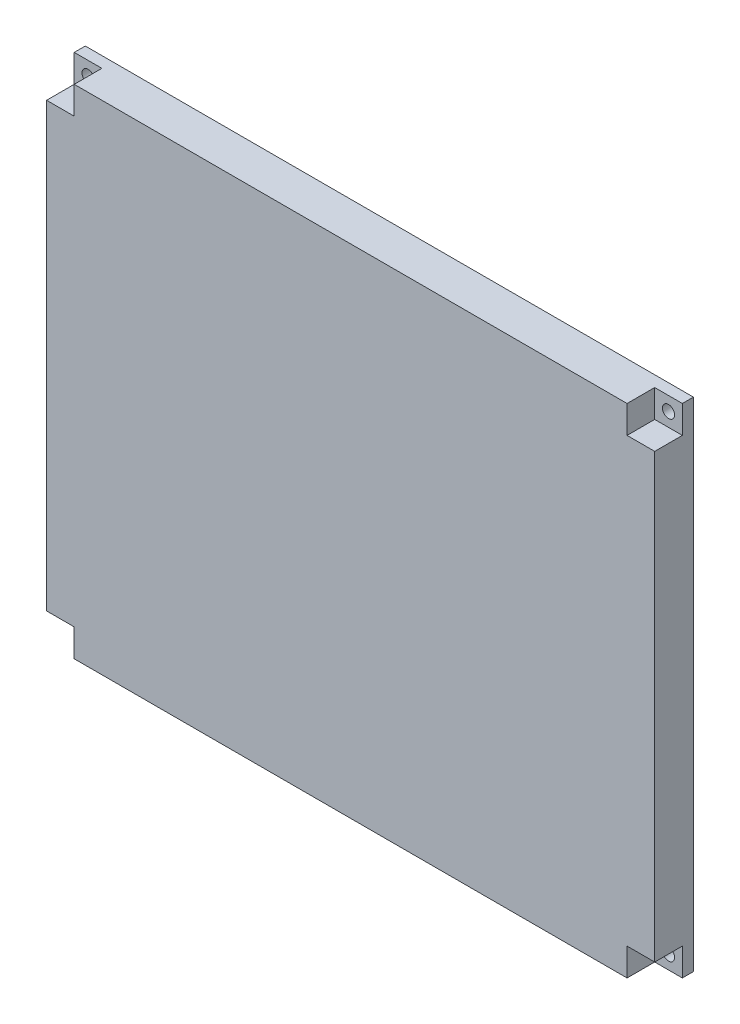
ISO-10303-21;
HEADER;
FILE_DESCRIPTION(('STEP AP214'),'2;1');
FILE_NAME('part.step','',(''),(''),'','','');
FILE_SCHEMA(('AUTOMOTIVE_DESIGN { 1 0 10303 214 1 1 1 1 }'));
ENDSEC;
DATA;
#1=APPLICATION_CONTEXT('core data for automotive mechanical design processes');
#2=APPLICATION_PROTOCOL_DEFINITION('international standard','automotive_design',2000,#1);
#3=PRODUCT_CONTEXT('',#1,'mechanical');
#4=PRODUCT('Part','Part','',(#3));
#5=PRODUCT_RELATED_PRODUCT_CATEGORY('part','',(#4));
#6=PRODUCT_DEFINITION_FORMATION('','',#4);
#7=PRODUCT_DEFINITION_CONTEXT('part definition',#1,'design');
#8=PRODUCT_DEFINITION('design','',#6,#7);
#9=PRODUCT_DEFINITION_SHAPE('','',#8);
#10=(LENGTH_UNIT() NAMED_UNIT(*) SI_UNIT(.MILLI.,.METRE.));
#11=(NAMED_UNIT(*) PLANE_ANGLE_UNIT() SI_UNIT($,.RADIAN.));
#12=(NAMED_UNIT(*) SI_UNIT($,.STERADIAN.) SOLID_ANGLE_UNIT());
#13=UNCERTAINTY_MEASURE_WITH_UNIT(LENGTH_MEASURE(1.E-05),#10,'distance_accuracy_value','');
#14=(GEOMETRIC_REPRESENTATION_CONTEXT(3) GLOBAL_UNCERTAINTY_ASSIGNED_CONTEXT((#13)) GLOBAL_UNIT_ASSIGNED_CONTEXT((#10,
#11,#12)) REPRESENTATION_CONTEXT('',''));
#15=CARTESIAN_POINT('',(0.,0.,0.));
#16=DIRECTION('',(0.,0.,1.));
#17=DIRECTION('',(1.,0.,0.));
#18=AXIS2_PLACEMENT_3D('',#15,#16,#17);
#19=CARTESIAN_POINT('',(-89.0867155495886,42.9813664596273,10.));
#20=DIRECTION('',(0.,1.,0.));
#21=DIRECTION('',(0.,0.,1.));
#22=AXIS2_PLACEMENT_3D('',#19,#20,#21);
#23=PLANE('',#22);
#24=DIRECTION('',(1.,0.,0.));
#25=VECTOR('',#24,1.);
#26=CARTESIAN_POINT('',(-84.0867155495887,42.9813664596273,3.));
#27=LINE('',#26,#25);
#28=CARTESIAN_POINT('',(-84.0867155495886,42.9813664596273,3.));
#29=VERTEX_POINT('',#28);
#30=CARTESIAN_POINT('',(25.9132844504113,42.9813664596273,3.));
#31=VERTEX_POINT('',#30);
#32=EDGE_CURVE('E177',#29,#31,#27,.T.);
#33=ORIENTED_EDGE('',*,*,#32,.F.);
#34=DIRECTION('',(0.,0.,-1.));
#35=VECTOR('',#34,1.);
#36=CARTESIAN_POINT('',(-84.0867155495886,42.9813664596273,3.));
#37=LINE('',#36,#35);
#38=CARTESIAN_POINT('',(-84.0867155495886,42.9813664596273,5.));
#39=VERTEX_POINT('',#38);
#40=EDGE_CURVE('E57',#39,#29,#37,.T.);
#41=ORIENTED_EDGE('',*,*,#40,.F.);
#42=DIRECTION('',(-1.,0.,0.));
#43=VECTOR('',#42,1.);
#44=CARTESIAN_POINT('',(-84.0867155495886,42.9813664596273,5.));
#45=LINE('',#44,#43);
#46=CARTESIAN_POINT('',(-79.0867155495886,42.9813664596273,5.));
#47=VERTEX_POINT('',#46);
#48=EDGE_CURVE('E297',#47,#39,#45,.T.);
#49=ORIENTED_EDGE('',*,*,#48,.F.);
#50=DIRECTION('',(0.,0.,1.));
#51=VECTOR('',#50,1.);
#52=CARTESIAN_POINT('',(-79.0867155495886,42.9813664596273,5.));
#53=LINE('',#52,#51);
#54=CARTESIAN_POINT('',(-79.0867155495886,42.9813664596273,10.));
#55=VERTEX_POINT('',#54);
#56=EDGE_CURVE('E307',#47,#55,#53,.T.);
#57=ORIENTED_EDGE('',*,*,#56,.T.);
#58=DIRECTION('',(1.,0.,0.));
#59=VECTOR('',#58,1.);
#60=CARTESIAN_POINT('',(-89.0867155495886,42.9813664596273,10.));
#61=LINE('',#60,#59);
#62=CARTESIAN_POINT('',(20.9132844504113,42.9813664596273,10.));
#63=VERTEX_POINT('',#62);
#64=EDGE_CURVE('E49',#55,#63,#61,.T.);
#65=ORIENTED_EDGE('',*,*,#64,.T.);
#66=DIRECTION('',(0.,0.,1.));
#67=VECTOR('',#66,1.);
#68=CARTESIAN_POINT('',(20.9132844504113,42.9813664596273,5.));
#69=LINE('',#68,#67);
#70=CARTESIAN_POINT('',(20.9132844504113,42.9813664596273,5.));
#71=VERTEX_POINT('',#70);
#72=EDGE_CURVE('E238',#71,#63,#69,.T.);
#73=ORIENTED_EDGE('',*,*,#72,.F.);
#74=DIRECTION('',(-1.,0.,0.));
#75=VECTOR('',#74,1.);
#76=CARTESIAN_POINT('',(25.9132844504113,42.9813664596273,5.));
#77=LINE('',#76,#75);
#78=CARTESIAN_POINT('',(25.9132844504113,42.9813664596273,5.));
#79=VERTEX_POINT('',#78);
#80=EDGE_CURVE('E225',#79,#71,#77,.T.);
#81=ORIENTED_EDGE('',*,*,#80,.F.);
#82=DIRECTION('',(0.,0.,1.));
#83=VECTOR('',#82,1.);
#84=CARTESIAN_POINT('',(25.9132844504113,42.9813664596273,3.));
#85=LINE('',#84,#83);
#86=EDGE_CURVE('E352',#31,#79,#85,.T.);
#87=ORIENTED_EDGE('',*,*,#86,.F.);
#88=EDGE_LOOP('',(#33,#41,#49,#57,#65,#73,#81,#87));
#89=FACE_BOUND('',#88,.T.);
#90=ADVANCED_FACE('F40',(#89),#23,.T.);
#91=CARTESIAN_POINT('',(-89.0867155495886,-47.0186335403727,10.));
#92=DIRECTION('',(0.,1.,0.));
#93=DIRECTION('',(0.,0.,1.));
#94=AXIS2_PLACEMENT_3D('',#91,#92,#93);
#95=PLANE('',#94);
#96=DIRECTION('',(0.,0.,1.));
#97=VECTOR('',#96,1.);
#98=CARTESIAN_POINT('',(-84.0867155495886,-47.0186335403727,3.));
#99=LINE('',#98,#97);
#100=CARTESIAN_POINT('',(-84.0867155495886,-47.0186335403727,3.));
#101=VERTEX_POINT('',#100);
#102=CARTESIAN_POINT('',(-84.0867155495886,-47.0186335403727,5.));
#103=VERTEX_POINT('',#102);
#104=EDGE_CURVE('E156',#101,#103,#99,.T.);
#105=ORIENTED_EDGE('',*,*,#104,.F.);
#106=DIRECTION('',(-1.,0.,0.));
#107=VECTOR('',#106,1.);
#108=CARTESIAN_POINT('',(25.9132844504114,-47.0186335403726,3.));
#109=LINE('',#108,#107);
#110=CARTESIAN_POINT('',(25.9132844504114,-47.0186335403726,3.));
#111=VERTEX_POINT('',#110);
#112=EDGE_CURVE('E167',#111,#101,#109,.T.);
#113=ORIENTED_EDGE('',*,*,#112,.F.);
#114=DIRECTION('',(0.,0.,-1.));
#115=VECTOR('',#114,1.);
#116=CARTESIAN_POINT('',(25.9132844504114,-47.0186335403727,3.));
#117=LINE('',#116,#115);
#118=CARTESIAN_POINT('',(25.9132844504114,-47.0186335403727,5.));
#119=VERTEX_POINT('',#118);
#120=EDGE_CURVE('E65',#119,#111,#117,.T.);
#121=ORIENTED_EDGE('',*,*,#120,.F.);
#122=DIRECTION('',(1.,0.,0.));
#123=VECTOR('',#122,1.);
#124=CARTESIAN_POINT('',(25.9132844504113,-47.0186335403727,5.));
#125=LINE('',#124,#123);
#126=CARTESIAN_POINT('',(20.9132844504113,-47.0186335403727,5.));
#127=VERTEX_POINT('',#126);
#128=EDGE_CURVE('E187',#127,#119,#125,.T.);
#129=ORIENTED_EDGE('',*,*,#128,.F.);
#130=DIRECTION('',(0.,0.,1.));
#131=VECTOR('',#130,1.);
#132=CARTESIAN_POINT('',(20.9132844504113,-47.0186335403727,5.));
#133=LINE('',#132,#131);
#134=CARTESIAN_POINT('',(20.9132844504113,-47.0186335403727,10.));
#135=VERTEX_POINT('',#134);
#136=EDGE_CURVE('E210',#127,#135,#133,.T.);
#137=ORIENTED_EDGE('',*,*,#136,.T.);
#138=DIRECTION('',(1.,0.,0.));
#139=VECTOR('',#138,1.);
#140=CARTESIAN_POINT('',(-89.0867155495886,-47.0186335403727,10.));
#141=LINE('',#140,#139);
#142=CARTESIAN_POINT('',(-79.0867155495886,-47.0186335403727,10.));
#143=VERTEX_POINT('',#142);
#144=EDGE_CURVE('E11',#143,#135,#141,.T.);
#145=ORIENTED_EDGE('',*,*,#144,.F.);
#146=DIRECTION('',(0.,0.,1.));
#147=VECTOR('',#146,1.);
#148=CARTESIAN_POINT('',(-79.0867155495886,-47.0186335403727,5.));
#149=LINE('',#148,#147);
#150=CARTESIAN_POINT('',(-79.0867155495886,-47.0186335403727,5.));
#151=VERTEX_POINT('',#150);
#152=EDGE_CURVE('E270',#151,#143,#149,.T.);
#153=ORIENTED_EDGE('',*,*,#152,.F.);
#154=DIRECTION('',(1.,0.,0.));
#155=VECTOR('',#154,1.);
#156=CARTESIAN_POINT('',(-84.0867155495886,-47.0186335403726,5.));
#157=LINE('',#156,#155);
#158=EDGE_CURVE('E170',#103,#151,#157,.T.);
#159=ORIENTED_EDGE('',*,*,#158,.F.);
#160=EDGE_LOOP('',(#105,#113,#121,#129,#137,#145,#153,#159));
#161=FACE_BOUND('',#160,.T.);
#162=ADVANCED_FACE('F166',(#161),#95,.F.);
#163=CARTESIAN_POINT('',(0.,0.,10.));
#164=DIRECTION('',(0.,0.,-1.));
#165=DIRECTION('',(-1.,0.,0.));
#166=AXIS2_PLACEMENT_3D('',#163,#164,#165);
#167=PLANE('',#166);
#168=DIRECTION('',(0.,1.,0.));
#169=VECTOR('',#168,1.);
#170=CARTESIAN_POINT('',(-84.0867155495886,42.9813664596273,10.));
#171=LINE('',#170,#169);
#172=CARTESIAN_POINT('',(-84.0867155495886,-42.0186335403727,10.));
#173=VERTEX_POINT('',#172);
#174=CARTESIAN_POINT('',(-84.0867155495886,37.9813664596273,10.));
#175=VERTEX_POINT('',#174);
#176=EDGE_CURVE('E172',#173,#175,#171,.T.);
#177=ORIENTED_EDGE('',*,*,#176,.F.);
#178=DIRECTION('',(-1.,0.,0.));
#179=VECTOR('',#178,1.);
#180=CARTESIAN_POINT('',(-84.0867155495886,-42.0186335403727,10.));
#181=LINE('',#180,#179);
#182=CARTESIAN_POINT('',(-79.0867155495886,-42.0186335403727,10.));
#183=VERTEX_POINT('',#182);
#184=EDGE_CURVE('E259',#183,#173,#181,.T.);
#185=ORIENTED_EDGE('',*,*,#184,.F.);
#186=DIRECTION('',(0.,1.,0.));
#187=VECTOR('',#186,1.);
#188=CARTESIAN_POINT('',(-79.0867155495886,-47.0186335403727,10.));
#189=LINE('',#188,#187);
#190=EDGE_CURVE('E214',#143,#183,#189,.T.);
#191=ORIENTED_EDGE('',*,*,#190,.F.);
#192=ORIENTED_EDGE('',*,*,#144,.T.);
#193=DIRECTION('',(0.,-1.,0.));
#194=VECTOR('',#193,1.);
#195=CARTESIAN_POINT('',(20.9132844504113,-47.0186335403727,10.));
#196=LINE('',#195,#194);
#197=CARTESIAN_POINT('',(20.9132844504113,-42.0186335403727,10.));
#198=VERTEX_POINT('',#197);
#199=EDGE_CURVE('E192',#198,#135,#196,.T.);
#200=ORIENTED_EDGE('',*,*,#199,.F.);
#201=DIRECTION('',(-1.,0.,0.));
#202=VECTOR('',#201,1.);
#203=CARTESIAN_POINT('',(25.9132844504113,-42.0186335403727,10.));
#204=LINE('',#203,#202);
#205=CARTESIAN_POINT('',(25.9132844504114,-42.0186335403727,10.));
#206=VERTEX_POINT('',#205);
#207=EDGE_CURVE('E182',#206,#198,#204,.T.);
#208=ORIENTED_EDGE('',*,*,#207,.F.);
#209=DIRECTION('',(0.,-1.,0.));
#210=VECTOR('',#209,1.);
#211=CARTESIAN_POINT('',(25.9132844504113,42.9813664596273,10.));
#212=LINE('',#211,#210);
#213=CARTESIAN_POINT('',(25.9132844504113,37.9813664596273,10.));
#214=VERTEX_POINT('',#213);
#215=EDGE_CURVE('E349',#214,#206,#212,.T.);
#216=ORIENTED_EDGE('',*,*,#215,.F.);
#217=DIRECTION('',(1.,0.,0.));
#218=VECTOR('',#217,1.);
#219=CARTESIAN_POINT('',(25.9132844504113,37.9813664596273,10.));
#220=LINE('',#219,#218);
#221=CARTESIAN_POINT('',(20.9132844504113,37.9813664596273,10.));
#222=VERTEX_POINT('',#221);
#223=EDGE_CURVE('E226',#222,#214,#220,.T.);
#224=ORIENTED_EDGE('',*,*,#223,.F.);
#225=DIRECTION('',(0.,-1.,0.));
#226=VECTOR('',#225,1.);
#227=CARTESIAN_POINT('',(20.9132844504113,42.9813664596273,10.));
#228=LINE('',#227,#226);
#229=EDGE_CURVE('E239',#63,#222,#228,.T.);
#230=ORIENTED_EDGE('',*,*,#229,.F.);
#231=ORIENTED_EDGE('',*,*,#64,.F.);
#232=DIRECTION('',(0.,1.,0.));
#233=VECTOR('',#232,1.);
#234=CARTESIAN_POINT('',(-79.0867155495886,42.9813664596273,10.));
#235=LINE('',#234,#233);
#236=CARTESIAN_POINT('',(-79.0867155495886,37.9813664596273,10.));
#237=VERTEX_POINT('',#236);
#238=EDGE_CURVE('E289',#237,#55,#235,.T.);
#239=ORIENTED_EDGE('',*,*,#238,.F.);
#240=DIRECTION('',(1.,0.,0.));
#241=VECTOR('',#240,1.);
#242=CARTESIAN_POINT('',(-84.0867155495886,37.9813664596273,10.));
#243=LINE('',#242,#241);
#244=EDGE_CURVE('E250',#175,#237,#243,.T.);
#245=ORIENTED_EDGE('',*,*,#244,.F.);
#246=EDGE_LOOP('',(#177,#185,#191,#192,#200,#208,#216,#224,#230,#231,#239,#245));
#247=FACE_BOUND('',#246,.T.);
#248=ADVANCED_FACE('F369',(#247),#167,.F.);
#249=CARTESIAN_POINT('',(0.,0.,3.));
#250=DIRECTION('',(0.,0.,1.));
#251=DIRECTION('',(1.,0.,0.));
#252=AXIS2_PLACEMENT_3D('',#249,#250,#251);
#253=PLANE('',#252);
#254=CARTESIAN_POINT('',(23.4132844504114,40.4813664596273,3.));
#255=DIRECTION('',(0.,0.,-1.));
#256=DIRECTION('',(-1.,0.,0.));
#257=AXIS2_PLACEMENT_3D('',#254,#255,#256);
#258=CIRCLE('',#257,1.1);
#259=CARTESIAN_POINT('',(22.3132844504114,40.4813664596273,3.));
#260=VERTEX_POINT('',#259);
#261=EDGE_CURVE('E43',#260,#260,#258,.T.);
#262=ORIENTED_EDGE('',*,*,#261,.F.);
#263=EDGE_LOOP('',(#262));
#264=FACE_BOUND('',#263,.T.);
#265=CARTESIAN_POINT('',(-81.5867155495887,40.4813664596273,3.));
#266=DIRECTION('',(0.,0.,1.));
#267=DIRECTION('',(1.,0.,0.));
#268=AXIS2_PLACEMENT_3D('',#265,#266,#267);
#269=CIRCLE('',#268,1.1);
#270=CARTESIAN_POINT('',(-80.4867155495887,40.4813664596273,3.));
#271=VERTEX_POINT('',#270);
#272=EDGE_CURVE('E329',#271,#271,#269,.T.);
#273=ORIENTED_EDGE('',*,*,#272,.T.);
#274=EDGE_LOOP('',(#273));
#275=FACE_BOUND('',#274,.T.);
#276=CARTESIAN_POINT('',(-81.5867155495887,-44.5186335403726,3.));
#277=DIRECTION('',(0.,0.,1.));
#278=DIRECTION('',(1.,0.,0.));
#279=AXIS2_PLACEMENT_3D('',#276,#277,#278);
#280=CIRCLE('',#279,1.1);
#281=CARTESIAN_POINT('',(-80.4867155495887,-44.5186335403726,3.));
#282=VERTEX_POINT('',#281);
#283=EDGE_CURVE('E325',#282,#282,#280,.T.);
#284=ORIENTED_EDGE('',*,*,#283,.T.);
#285=EDGE_LOOP('',(#284));
#286=FACE_BOUND('',#285,.T.);
#287=CARTESIAN_POINT('',(23.4132844504114,-44.5186335403726,3.));
#288=DIRECTION('',(0.,0.,1.));
#289=DIRECTION('',(1.,0.,0.));
#290=AXIS2_PLACEMENT_3D('',#287,#288,#289);
#291=CIRCLE('',#290,1.1);
#292=CARTESIAN_POINT('',(24.5132844504114,-44.5186335403726,3.));
#293=VERTEX_POINT('',#292);
#294=EDGE_CURVE('E320',#293,#293,#291,.T.);
#295=ORIENTED_EDGE('',*,*,#294,.T.);
#296=EDGE_LOOP('',(#295));
#297=FACE_BOUND('',#296,.T.);
#298=DIRECTION('',(0.,-1.,0.));
#299=VECTOR('',#298,1.);
#300=CARTESIAN_POINT('',(-84.0867155495886,42.9813664596273,3.));
#301=LINE('',#300,#299);
#302=EDGE_CURVE('E153',#29,#101,#301,.T.);
#303=ORIENTED_EDGE('',*,*,#302,.F.);
#304=ORIENTED_EDGE('',*,*,#32,.T.);
#305=DIRECTION('',(0.,1.,0.));
#306=VECTOR('',#305,1.);
#307=CARTESIAN_POINT('',(25.9132844504113,42.9813664596273,3.));
#308=LINE('',#307,#306);
#309=EDGE_CURVE('E175',#111,#31,#308,.T.);
#310=ORIENTED_EDGE('',*,*,#309,.F.);
#311=ORIENTED_EDGE('',*,*,#112,.T.);
#312=EDGE_LOOP('',(#303,#304,#310,#311));
#313=FACE_BOUND('',#312,.T.);
#314=ADVANCED_FACE('F174',(#264,#275,#286,#297,#313),#253,.F.);
#315=CARTESIAN_POINT('',(-79.0867155495886,42.9813664596273,5.));
#316=DIRECTION('',(1.,0.,0.));
#317=DIRECTION('',(0.,0.,-1.));
#318=AXIS2_PLACEMENT_3D('',#315,#316,#317);
#319=PLANE('',#318);
#320=ORIENTED_EDGE('',*,*,#238,.T.);
#321=ORIENTED_EDGE('',*,*,#56,.F.);
#322=DIRECTION('',(0.,1.,0.));
#323=VECTOR('',#322,1.);
#324=CARTESIAN_POINT('',(-79.0867155495886,42.9813664596273,5.));
#325=LINE('',#324,#323);
#326=CARTESIAN_POINT('',(-79.0867155495886,37.9813664596273,5.));
#327=VERTEX_POINT('',#326);
#328=EDGE_CURVE('E293',#327,#47,#325,.T.);
#329=ORIENTED_EDGE('',*,*,#328,.F.);
#330=DIRECTION('',(0.,0.,1.));
#331=VECTOR('',#330,1.);
#332=CARTESIAN_POINT('',(-79.0867155495886,37.9813664596273,5.));
#333=LINE('',#332,#331);
#334=EDGE_CURVE('E311',#327,#237,#333,.T.);
#335=ORIENTED_EDGE('',*,*,#334,.T.);
#336=EDGE_LOOP('',(#320,#321,#329,#335));
#337=FACE_BOUND('',#336,.T.);
#338=ADVANCED_FACE('F373',(#337),#319,.F.);
#339=CARTESIAN_POINT('',(-84.0867155495886,37.9813664596273,5.));
#340=DIRECTION('',(0.,-1.,0.));
#341=DIRECTION('',(0.,0.,-1.));
#342=AXIS2_PLACEMENT_3D('',#339,#340,#341);
#343=PLANE('',#342);
#344=ORIENTED_EDGE('',*,*,#244,.T.);
#345=ORIENTED_EDGE('',*,*,#334,.F.);
#346=DIRECTION('',(1.,0.,0.));
#347=VECTOR('',#346,1.);
#348=CARTESIAN_POINT('',(-84.0867155495886,37.9813664596273,5.));
#349=LINE('',#348,#347);
#350=CARTESIAN_POINT('',(-84.0867155495886,37.9813664596273,5.));
#351=VERTEX_POINT('',#350);
#352=EDGE_CURVE('E288',#351,#327,#349,.T.);
#353=ORIENTED_EDGE('',*,*,#352,.F.);
#354=DIRECTION('',(0.,0.,1.));
#355=VECTOR('',#354,1.);
#356=CARTESIAN_POINT('',(-84.0867155495886,37.9813664596273,5.));
#357=LINE('',#356,#355);
#358=EDGE_CURVE('E301',#351,#175,#357,.T.);
#359=ORIENTED_EDGE('',*,*,#358,.T.);
#360=EDGE_LOOP('',(#344,#345,#353,#359));
#361=FACE_BOUND('',#360,.T.);
#362=ADVANCED_FACE('F367',(#361),#343,.F.);
#363=CARTESIAN_POINT('',(0.,0.,5.));
#364=DIRECTION('',(0.,0.,1.));
#365=DIRECTION('',(1.,0.,0.));
#366=AXIS2_PLACEMENT_3D('',#363,#364,#365);
#367=PLANE('',#366);
#368=CARTESIAN_POINT('',(-81.5867155495887,40.4813664596273,5.));
#369=DIRECTION('',(0.,0.,1.));
#370=DIRECTION('',(1.,0.,0.));
#371=AXIS2_PLACEMENT_3D('',#368,#369,#370);
#372=CIRCLE('',#371,1.1);
#373=CARTESIAN_POINT('',(-80.4867155495887,40.4813664596273,5.));
#374=VERTEX_POINT('',#373);
#375=EDGE_CURVE('E332',#374,#374,#372,.T.);
#376=ORIENTED_EDGE('',*,*,#375,.F.);
#377=EDGE_LOOP('',(#376));
#378=FACE_BOUND('',#377,.T.);
#379=DIRECTION('',(0.,-1.,0.));
#380=VECTOR('',#379,1.);
#381=CARTESIAN_POINT('',(-84.0867155495886,42.9813664596273,5.));
#382=LINE('',#381,#380);
#383=EDGE_CURVE('E284',#39,#351,#382,.T.);
#384=ORIENTED_EDGE('',*,*,#383,.T.);
#385=ORIENTED_EDGE('',*,*,#352,.T.);
#386=ORIENTED_EDGE('',*,*,#328,.T.);
#387=ORIENTED_EDGE('',*,*,#48,.T.);
#388=EDGE_LOOP('',(#384,#385,#386,#387));
#389=FACE_BOUND('',#388,.T.);
#390=ADVANCED_FACE('F379',(#378,#389),#367,.T.);
#391=CARTESIAN_POINT('',(20.9132844504113,-47.0186335403727,5.));
#392=DIRECTION('',(-1.,0.,0.));
#393=DIRECTION('',(0.,0.,1.));
#394=AXIS2_PLACEMENT_3D('',#391,#392,#393);
#395=PLANE('',#394);
#396=ORIENTED_EDGE('',*,*,#199,.T.);
#397=ORIENTED_EDGE('',*,*,#136,.F.);
#398=DIRECTION('',(0.,-1.,0.));
#399=VECTOR('',#398,1.);
#400=CARTESIAN_POINT('',(20.9132844504113,-47.0186335403727,5.));
#401=LINE('',#400,#399);
#402=CARTESIAN_POINT('',(20.9132844504113,-42.0186335403727,5.));
#403=VERTEX_POINT('',#402);
#404=EDGE_CURVE('E200',#403,#127,#401,.T.);
#405=ORIENTED_EDGE('',*,*,#404,.F.);
#406=DIRECTION('',(0.,0.,1.));
#407=VECTOR('',#406,1.);
#408=CARTESIAN_POINT('',(20.9132844504113,-42.0186335403727,5.));
#409=LINE('',#408,#407);
#410=EDGE_CURVE('E215',#403,#198,#409,.T.);
#411=ORIENTED_EDGE('',*,*,#410,.T.);
#412=EDGE_LOOP('',(#396,#397,#405,#411));
#413=FACE_BOUND('',#412,.T.);
#414=ADVANCED_FACE('F381',(#413),#395,.F.);
#415=CARTESIAN_POINT('',(25.9132844504113,-42.0186335403727,5.));
#416=DIRECTION('',(0.,1.,0.));
#417=DIRECTION('',(0.,0.,1.));
#418=AXIS2_PLACEMENT_3D('',#415,#416,#417);
#419=PLANE('',#418);
#420=ORIENTED_EDGE('',*,*,#207,.T.);
#421=ORIENTED_EDGE('',*,*,#410,.F.);
#422=DIRECTION('',(-1.,0.,0.));
#423=VECTOR('',#422,1.);
#424=CARTESIAN_POINT('',(25.9132844504113,-42.0186335403727,5.));
#425=LINE('',#424,#423);
#426=CARTESIAN_POINT('',(25.9132844504114,-42.0186335403727,5.));
#427=VERTEX_POINT('',#426);
#428=EDGE_CURVE('E196',#427,#403,#425,.T.);
#429=ORIENTED_EDGE('',*,*,#428,.F.);
#430=DIRECTION('',(0.,0.,1.));
#431=VECTOR('',#430,1.);
#432=CARTESIAN_POINT('',(25.9132844504113,-42.0186335403727,5.));
#433=LINE('',#432,#431);
#434=EDGE_CURVE('E204',#427,#206,#433,.T.);
#435=ORIENTED_EDGE('',*,*,#434,.T.);
#436=EDGE_LOOP('',(#420,#421,#429,#435));
#437=FACE_BOUND('',#436,.T.);
#438=ADVANCED_FACE('F388',(#437),#419,.F.);
#439=CARTESIAN_POINT('',(0.,0.,5.));
#440=DIRECTION('',(0.,0.,-1.));
#441=DIRECTION('',(-1.,0.,0.));
#442=AXIS2_PLACEMENT_3D('',#439,#440,#441);
#443=PLANE('',#442);
#444=CARTESIAN_POINT('',(23.4132844504114,-44.5186335403726,5.));
#445=DIRECTION('',(0.,0.,-1.));
#446=DIRECTION('',(-1.,0.,0.));
#447=AXIS2_PLACEMENT_3D('',#444,#445,#446);
#448=CIRCLE('',#447,1.1);
#449=CARTESIAN_POINT('',(22.3132844504114,-44.5186335403726,5.));
#450=VERTEX_POINT('',#449);
#451=EDGE_CURVE('E324',#450,#450,#448,.T.);
#452=ORIENTED_EDGE('',*,*,#451,.T.);
#453=EDGE_LOOP('',(#452));
#454=FACE_BOUND('',#453,.T.);
#455=ORIENTED_EDGE('',*,*,#128,.T.);
#456=DIRECTION('',(0.,1.,0.));
#457=VECTOR('',#456,1.);
#458=CARTESIAN_POINT('',(25.9132844504113,-47.0186335403727,5.));
#459=LINE('',#458,#457);
#460=EDGE_CURVE('E191',#119,#427,#459,.T.);
#461=ORIENTED_EDGE('',*,*,#460,.T.);
#462=ORIENTED_EDGE('',*,*,#428,.T.);
#463=ORIENTED_EDGE('',*,*,#404,.T.);
#464=EDGE_LOOP('',(#455,#461,#462,#463));
#465=FACE_BOUND('',#464,.T.);
#466=ADVANCED_FACE('F416',(#454,#465),#443,.F.);
#467=CARTESIAN_POINT('',(-84.0867155495886,-42.0186335403727,5.));
#468=DIRECTION('',(0.,1.,0.));
#469=DIRECTION('',(0.,0.,1.));
#470=AXIS2_PLACEMENT_3D('',#467,#468,#469);
#471=PLANE('',#470);
#472=ORIENTED_EDGE('',*,*,#184,.T.);
#473=DIRECTION('',(0.,0.,1.));
#474=VECTOR('',#473,1.);
#475=CARTESIAN_POINT('',(-84.0867155495886,-42.0186335403727,5.));
#476=LINE('',#475,#474);
#477=CARTESIAN_POINT('',(-84.0867155495886,-42.0186335403727,5.));
#478=VERTEX_POINT('',#477);
#479=EDGE_CURVE('E243',#478,#173,#476,.T.);
#480=ORIENTED_EDGE('',*,*,#479,.F.);
#481=DIRECTION('',(-1.,0.,0.));
#482=VECTOR('',#481,1.);
#483=CARTESIAN_POINT('',(-84.0867155495886,-42.0186335403727,5.));
#484=LINE('',#483,#482);
#485=CARTESIAN_POINT('',(-79.0867155495886,-42.0186335403727,5.));
#486=VERTEX_POINT('',#485);
#487=EDGE_CURVE('E266',#486,#478,#484,.T.);
#488=ORIENTED_EDGE('',*,*,#487,.F.);
#489=DIRECTION('',(0.,0.,1.));
#490=VECTOR('',#489,1.);
#491=CARTESIAN_POINT('',(-79.0867155495886,-42.0186335403727,5.));
#492=LINE('',#491,#490);
#493=EDGE_CURVE('E279',#486,#183,#492,.T.);
#494=ORIENTED_EDGE('',*,*,#493,.T.);
#495=EDGE_LOOP('',(#472,#480,#488,#494));
#496=FACE_BOUND('',#495,.T.);
#497=ADVANCED_FACE('F418',(#496),#471,.F.);
#498=CARTESIAN_POINT('',(-79.0867155495886,-47.0186335403727,5.));
#499=DIRECTION('',(1.,0.,0.));
#500=DIRECTION('',(0.,0.,-1.));
#501=AXIS2_PLACEMENT_3D('',#498,#499,#500);
#502=PLANE('',#501);
#503=ORIENTED_EDGE('',*,*,#190,.T.);
#504=ORIENTED_EDGE('',*,*,#493,.F.);
#505=DIRECTION('',(0.,1.,0.));
#506=VECTOR('',#505,1.);
#507=CARTESIAN_POINT('',(-79.0867155495886,-47.0186335403727,5.));
#508=LINE('',#507,#506);
#509=EDGE_CURVE('E262',#151,#486,#508,.T.);
#510=ORIENTED_EDGE('',*,*,#509,.F.);
#511=ORIENTED_EDGE('',*,*,#152,.T.);
#512=EDGE_LOOP('',(#503,#504,#510,#511));
#513=FACE_BOUND('',#512,.T.);
#514=ADVANCED_FACE('F440',(#513),#502,.F.);
#515=CARTESIAN_POINT('',(0.,0.,5.));
#516=DIRECTION('',(0.,0.,-1.));
#517=DIRECTION('',(-1.,0.,0.));
#518=AXIS2_PLACEMENT_3D('',#515,#516,#517);
#519=PLANE('',#518);
#520=CARTESIAN_POINT('',(-81.5867155495887,-44.5186335403726,5.));
#521=DIRECTION('',(0.,0.,-1.));
#522=DIRECTION('',(-1.,0.,0.));
#523=AXIS2_PLACEMENT_3D('',#520,#521,#522);
#524=CIRCLE('',#523,1.1);
#525=CARTESIAN_POINT('',(-82.6867155495887,-44.5186335403726,5.));
#526=VERTEX_POINT('',#525);
#527=EDGE_CURVE('E328',#526,#526,#524,.T.);
#528=ORIENTED_EDGE('',*,*,#527,.T.);
#529=EDGE_LOOP('',(#528));
#530=FACE_BOUND('',#529,.T.);
#531=DIRECTION('',(0.,-1.,0.));
#532=VECTOR('',#531,1.);
#533=CARTESIAN_POINT('',(-84.0867155495886,-47.0186335403726,5.));
#534=LINE('',#533,#532);
#535=EDGE_CURVE('E256',#478,#103,#534,.T.);
#536=ORIENTED_EDGE('',*,*,#535,.T.);
#537=ORIENTED_EDGE('',*,*,#158,.T.);
#538=ORIENTED_EDGE('',*,*,#509,.T.);
#539=ORIENTED_EDGE('',*,*,#487,.T.);
#540=EDGE_LOOP('',(#536,#537,#538,#539));
#541=FACE_BOUND('',#540,.T.);
#542=ADVANCED_FACE('F433',(#530,#541),#519,.F.);
#543=CARTESIAN_POINT('',(25.9132844504113,37.9813664596273,5.));
#544=DIRECTION('',(0.,-1.,0.));
#545=DIRECTION('',(0.,0.,-1.));
#546=AXIS2_PLACEMENT_3D('',#543,#544,#545);
#547=PLANE('',#546);
#548=ORIENTED_EDGE('',*,*,#223,.T.);
#549=DIRECTION('',(0.,0.,1.));
#550=VECTOR('',#549,1.);
#551=CARTESIAN_POINT('',(25.9132844504113,37.9813664596273,5.));
#552=LINE('',#551,#550);
#553=CARTESIAN_POINT('',(25.9132844504113,37.9813664596273,5.));
#554=VERTEX_POINT('',#553);
#555=EDGE_CURVE('E247',#554,#214,#552,.T.);
#556=ORIENTED_EDGE('',*,*,#555,.F.);
#557=DIRECTION('',(1.,0.,0.));
#558=VECTOR('',#557,1.);
#559=CARTESIAN_POINT('',(25.9132844504113,37.9813664596273,5.));
#560=LINE('',#559,#558);
#561=CARTESIAN_POINT('',(20.9132844504113,37.9813664596273,5.));
#562=VERTEX_POINT('',#561);
#563=EDGE_CURVE('E234',#562,#554,#560,.T.);
#564=ORIENTED_EDGE('',*,*,#563,.F.);
#565=DIRECTION('',(0.,0.,1.));
#566=VECTOR('',#565,1.);
#567=CARTESIAN_POINT('',(20.9132844504113,37.9813664596273,5.));
#568=LINE('',#567,#566);
#569=EDGE_CURVE('E251',#562,#222,#568,.T.);
#570=ORIENTED_EDGE('',*,*,#569,.T.);
#571=EDGE_LOOP('',(#548,#556,#564,#570));
#572=FACE_BOUND('',#571,.T.);
#573=ADVANCED_FACE('F430',(#572),#547,.F.);
#574=CARTESIAN_POINT('',(20.9132844504113,42.9813664596273,5.));
#575=DIRECTION('',(-1.,0.,0.));
#576=DIRECTION('',(0.,0.,1.));
#577=AXIS2_PLACEMENT_3D('',#574,#575,#576);
#578=PLANE('',#577);
#579=ORIENTED_EDGE('',*,*,#229,.T.);
#580=ORIENTED_EDGE('',*,*,#569,.F.);
#581=DIRECTION('',(0.,-1.,0.));
#582=VECTOR('',#581,1.);
#583=CARTESIAN_POINT('',(20.9132844504113,42.9813664596273,5.));
#584=LINE('',#583,#582);
#585=EDGE_CURVE('E230',#71,#562,#584,.T.);
#586=ORIENTED_EDGE('',*,*,#585,.F.);
#587=ORIENTED_EDGE('',*,*,#72,.T.);
#588=EDGE_LOOP('',(#579,#580,#586,#587));
#589=FACE_BOUND('',#588,.T.);
#590=ADVANCED_FACE('F428',(#589),#578,.F.);
#591=CARTESIAN_POINT('',(0.,0.,5.));
#592=DIRECTION('',(0.,0.,-1.));
#593=DIRECTION('',(-1.,0.,0.));
#594=AXIS2_PLACEMENT_3D('',#591,#592,#593);
#595=PLANE('',#594);
#596=CARTESIAN_POINT('',(23.4132844504114,40.4813664596273,5.));
#597=DIRECTION('',(0.,0.,-1.));
#598=DIRECTION('',(-1.,0.,0.));
#599=AXIS2_PLACEMENT_3D('',#596,#597,#598);
#600=CIRCLE('',#599,1.1);
#601=CARTESIAN_POINT('',(22.3132844504114,40.4813664596273,5.));
#602=VERTEX_POINT('',#601);
#603=EDGE_CURVE('E178',#602,#602,#600,.T.);
#604=ORIENTED_EDGE('',*,*,#603,.T.);
#605=EDGE_LOOP('',(#604));
#606=FACE_BOUND('',#605,.T.);
#607=DIRECTION('',(0.,1.,0.));
#608=VECTOR('',#607,1.);
#609=CARTESIAN_POINT('',(25.9132844504113,42.9813664596273,5.));
#610=LINE('',#609,#608);
#611=EDGE_CURVE('E221',#554,#79,#610,.T.);
#612=ORIENTED_EDGE('',*,*,#611,.T.);
#613=ORIENTED_EDGE('',*,*,#80,.T.);
#614=ORIENTED_EDGE('',*,*,#585,.T.);
#615=ORIENTED_EDGE('',*,*,#563,.T.);
#616=EDGE_LOOP('',(#612,#613,#614,#615));
#617=FACE_BOUND('',#616,.T.);
#618=ADVANCED_FACE('F424',(#606,#617),#595,.F.);
#619=CARTESIAN_POINT('',(23.4132844504114,-44.5186335403726,42.));
#620=DIRECTION('',(0.,0.,-1.));
#621=DIRECTION('',(-1.,0.,0.));
#622=AXIS2_PLACEMENT_3D('',#619,#620,#621);
#623=CYLINDRICAL_SURFACE('',#622,1.1);
#624=ORIENTED_EDGE('',*,*,#294,.F.);
#625=EDGE_LOOP('',(#624));
#626=FACE_BOUND('',#625,.T.);
#627=ORIENTED_EDGE('',*,*,#451,.F.);
#628=EDGE_LOOP('',(#627));
#629=FACE_BOUND('',#628,.T.);
#630=ADVANCED_FACE('F427',(#626,#629),#623,.F.);
#631=CARTESIAN_POINT('',(-81.5867155495887,-44.5186335403726,42.));
#632=DIRECTION('',(0.,0.,-1.));
#633=DIRECTION('',(-1.,0.,0.));
#634=AXIS2_PLACEMENT_3D('',#631,#632,#633);
#635=CYLINDRICAL_SURFACE('',#634,1.1);
#636=ORIENTED_EDGE('',*,*,#283,.F.);
#637=EDGE_LOOP('',(#636));
#638=FACE_BOUND('',#637,.T.);
#639=ORIENTED_EDGE('',*,*,#527,.F.);
#640=EDGE_LOOP('',(#639));
#641=FACE_BOUND('',#640,.T.);
#642=ADVANCED_FACE('F477',(#638,#641),#635,.F.);
#643=CARTESIAN_POINT('',(-81.5867155495887,40.4813664596273,42.));
#644=DIRECTION('',(0.,0.,-1.));
#645=DIRECTION('',(-1.,0.,0.));
#646=AXIS2_PLACEMENT_3D('',#643,#644,#645);
#647=CYLINDRICAL_SURFACE('',#646,1.1);
#648=ORIENTED_EDGE('',*,*,#375,.T.);
#649=EDGE_LOOP('',(#648));
#650=FACE_BOUND('',#649,.T.);
#651=ORIENTED_EDGE('',*,*,#272,.F.);
#652=EDGE_LOOP('',(#651));
#653=FACE_BOUND('',#652,.T.);
#654=ADVANCED_FACE('F472',(#650,#653),#647,.F.);
#655=CARTESIAN_POINT('',(23.4132844504114,40.4813664596273,42.));
#656=DIRECTION('',(0.,0.,-1.));
#657=DIRECTION('',(-1.,0.,0.));
#658=AXIS2_PLACEMENT_3D('',#655,#656,#657);
#659=CYLINDRICAL_SURFACE('',#658,1.1);
#660=ORIENTED_EDGE('',*,*,#261,.T.);
#661=EDGE_LOOP('',(#660));
#662=FACE_BOUND('',#661,.T.);
#663=ORIENTED_EDGE('',*,*,#603,.F.);
#664=EDGE_LOOP('',(#663));
#665=FACE_BOUND('',#664,.T.);
#666=ADVANCED_FACE('F414',(#662,#665),#659,.F.);
#667=CARTESIAN_POINT('',(25.9132844504114,0.,0.));
#668=DIRECTION('',(-1.,0.,0.));
#669=DIRECTION('',(0.,-1.,0.));
#670=AXIS2_PLACEMENT_3D('',#667,#668,#669);
#671=PLANE('',#670);
#672=ORIENTED_EDGE('',*,*,#460,.F.);
#673=ORIENTED_EDGE('',*,*,#120,.T.);
#674=ORIENTED_EDGE('',*,*,#309,.T.);
#675=ORIENTED_EDGE('',*,*,#86,.T.);
#676=ORIENTED_EDGE('',*,*,#611,.F.);
#677=ORIENTED_EDGE('',*,*,#555,.T.);
#678=ORIENTED_EDGE('',*,*,#215,.T.);
#679=ORIENTED_EDGE('',*,*,#434,.F.);
#680=EDGE_LOOP('',(#672,#673,#674,#675,#676,#677,#678,#679));
#681=FACE_BOUND('',#680,.T.);
#682=ADVANCED_FACE('F457',(#681),#671,.F.);
#683=CARTESIAN_POINT('',(-84.0867155495886,0.,0.));
#684=DIRECTION('',(-1.,0.,0.));
#685=DIRECTION('',(0.,-1.,0.));
#686=AXIS2_PLACEMENT_3D('',#683,#684,#685);
#687=PLANE('',#686);
#688=ORIENTED_EDGE('',*,*,#358,.F.);
#689=ORIENTED_EDGE('',*,*,#383,.F.);
#690=ORIENTED_EDGE('',*,*,#40,.T.);
#691=ORIENTED_EDGE('',*,*,#302,.T.);
#692=ORIENTED_EDGE('',*,*,#104,.T.);
#693=ORIENTED_EDGE('',*,*,#535,.F.);
#694=ORIENTED_EDGE('',*,*,#479,.T.);
#695=ORIENTED_EDGE('',*,*,#176,.T.);
#696=EDGE_LOOP('',(#688,#689,#690,#691,#692,#693,#694,#695));
#697=FACE_BOUND('',#696,.T.);
#698=ADVANCED_FACE('F155',(#697),#687,.T.);
#699=CLOSED_SHELL('',(#90,#162,#248,#314,#338,#362,#390,#414,#438,#466,#497,#514,#542,#573,#590,
#618,#630,#642,#654,#666,#682,#698));
#700=MANIFOLD_SOLID_BREP('B2',#699);
#701=ADVANCED_BREP_SHAPE_REPRESENTATION('',(#18,#700),#14);
#702=SHAPE_DEFINITION_REPRESENTATION(#9,#701);
ENDSEC;
END-ISO-10303-21;
